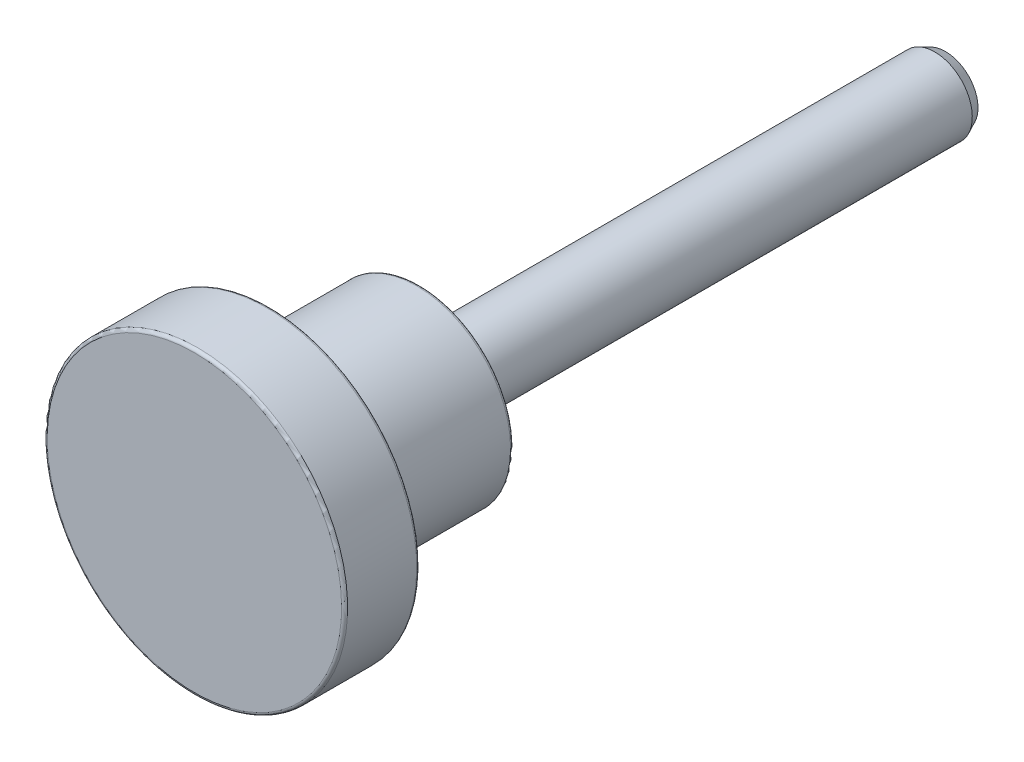
ISO-10303-21;
HEADER;
FILE_DESCRIPTION(('STEP AP214'),'2;1');
FILE_NAME('part.step','',(''),(''),'','','');
FILE_SCHEMA(('AUTOMOTIVE_DESIGN { 1 0 10303 214 1 1 1 1 }'));
ENDSEC;
DATA;
#1=APPLICATION_CONTEXT('core data for automotive mechanical design processes');
#2=APPLICATION_PROTOCOL_DEFINITION('international standard','automotive_design',2000,#1);
#3=PRODUCT_CONTEXT('',#1,'mechanical');
#4=PRODUCT('Part','Part','',(#3));
#5=PRODUCT_RELATED_PRODUCT_CATEGORY('part','',(#4));
#6=PRODUCT_DEFINITION_FORMATION('','',#4);
#7=PRODUCT_DEFINITION_CONTEXT('part definition',#1,'design');
#8=PRODUCT_DEFINITION('design','',#6,#7);
#9=PRODUCT_DEFINITION_SHAPE('','',#8);
#10=(LENGTH_UNIT() NAMED_UNIT(*) SI_UNIT(.MILLI.,.METRE.));
#11=(NAMED_UNIT(*) PLANE_ANGLE_UNIT() SI_UNIT($,.RADIAN.));
#12=(NAMED_UNIT(*) SI_UNIT($,.STERADIAN.) SOLID_ANGLE_UNIT());
#13=UNCERTAINTY_MEASURE_WITH_UNIT(LENGTH_MEASURE(1.E-05),#10,'distance_accuracy_value','');
#14=(GEOMETRIC_REPRESENTATION_CONTEXT(3) GLOBAL_UNCERTAINTY_ASSIGNED_CONTEXT((#13)) GLOBAL_UNIT_ASSIGNED_CONTEXT((#10,
#11,#12)) REPRESENTATION_CONTEXT('',''));
#15=CARTESIAN_POINT('',(0.,0.,0.));
#16=DIRECTION('',(0.,0.,1.));
#17=DIRECTION('',(1.,0.,0.));
#18=AXIS2_PLACEMENT_3D('',#15,#16,#17);
#19=CARTESIAN_POINT('',(0.,0.,8.5598));
#20=DIRECTION('',(0.,0.,-1.));
#21=DIRECTION('',(0.,1.,0.));
#22=AXIS2_PLACEMENT_3D('',#19,#20,#21);
#23=CYLINDRICAL_SURFACE('',#22,3.175);
#24=CARTESIAN_POINT('',(0.,0.,22.225));
#25=DIRECTION('',(0.,0.,1.));
#26=DIRECTION('',(0.,-1.,0.));
#27=AXIS2_PLACEMENT_3D('',#24,#25,#26);
#28=CIRCLE('',#27,3.175);
#29=CARTESIAN_POINT('',(0.,-3.175,22.225));
#30=VERTEX_POINT('',#29);
#31=EDGE_CURVE('E58',#30,#30,#28,.F.);
#32=ORIENTED_EDGE('',*,*,#31,.T.);
#33=EDGE_LOOP('',(#32));
#34=FACE_BOUND('',#33,.T.);
#35=CARTESIAN_POINT('',(0.,0.,-21.3178571428572));
#36=DIRECTION('',(0.,0.,1.));
#37=DIRECTION('',(0.,-1.,0.));
#38=AXIS2_PLACEMENT_3D('',#35,#36,#37);
#39=CIRCLE('',#38,3.175);
#40=CARTESIAN_POINT('',(0.,-3.17500000000001,-21.3178571428572));
#41=VERTEX_POINT('',#40);
#42=EDGE_CURVE('E67',#41,#41,#39,.T.);
#43=ORIENTED_EDGE('',*,*,#42,.T.);
#44=EDGE_LOOP('',(#43));
#45=FACE_BOUND('',#44,.T.);
#46=ADVANCED_FACE('F32',(#34,#45),#23,.T.);
#47=CARTESIAN_POINT('',(0.,7.9375,22.225));
#48=DIRECTION('',(0.,0.,1.));
#49=DIRECTION('',(0.,-1.,0.));
#50=AXIS2_PLACEMENT_3D('',#47,#48,#49);
#51=PLANE('',#50);
#52=CARTESIAN_POINT('',(0.,0.,22.225));
#53=DIRECTION('',(0.,0.,1.));
#54=DIRECTION('',(0.,-1.,0.));
#55=AXIS2_PLACEMENT_3D('',#52,#53,#54);
#56=CIRCLE('',#55,7.6835);
#57=CARTESIAN_POINT('',(0.,-7.6835,22.225));
#58=VERTEX_POINT('',#57);
#59=EDGE_CURVE('E52',#58,#58,#56,.F.);
#60=ORIENTED_EDGE('',*,*,#59,.T.);
#61=EDGE_LOOP('',(#60));
#62=FACE_BOUND('',#61,.T.);
#63=ORIENTED_EDGE('',*,*,#31,.F.);
#64=EDGE_LOOP('',(#63));
#65=FACE_BOUND('',#64,.T.);
#66=ADVANCED_FACE('F88',(#62,#65),#51,.F.);
#67=CARTESIAN_POINT('',(0.,0.,22.225));
#68=DIRECTION('',(0.,0.,1.));
#69=DIRECTION('',(0.,-1.,0.));
#70=AXIS2_PLACEMENT_3D('',#67,#68,#69);
#71=CYLINDRICAL_SURFACE('',#70,7.9375);
#72=CARTESIAN_POINT('',(0.,0.,22.479));
#73=DIRECTION('',(0.,0.,1.));
#74=DIRECTION('',(0.,-1.,0.));
#75=AXIS2_PLACEMENT_3D('',#72,#73,#74);
#76=CIRCLE('',#75,7.9375);
#77=CARTESIAN_POINT('',(0.,-7.9375,22.479));
#78=VERTEX_POINT('',#77);
#79=EDGE_CURVE('E55',#78,#78,#76,.T.);
#80=ORIENTED_EDGE('',*,*,#79,.T.);
#81=EDGE_LOOP('',(#80));
#82=FACE_BOUND('',#81,.T.);
#83=CARTESIAN_POINT('',(0.,0.,34.925));
#84=DIRECTION('',(0.,0.,1.));
#85=DIRECTION('',(0.,-1.,0.));
#86=AXIS2_PLACEMENT_3D('',#83,#84,#85);
#87=CIRCLE('',#86,7.9375);
#88=CARTESIAN_POINT('',(0.,-7.9375,34.925));
#89=VERTEX_POINT('',#88);
#90=EDGE_CURVE('E61',#89,#89,#87,.T.);
#91=ORIENTED_EDGE('',*,*,#90,.F.);
#92=EDGE_LOOP('',(#91));
#93=FACE_BOUND('',#92,.T.);
#94=ADVANCED_FACE('F94',(#82,#93),#71,.T.);
#95=CARTESIAN_POINT('',(0.,7.9375,34.925));
#96=DIRECTION('',(0.,0.,1.));
#97=DIRECTION('',(0.,-1.,0.));
#98=AXIS2_PLACEMENT_3D('',#95,#96,#97);
#99=PLANE('',#98);
#100=CARTESIAN_POINT('',(0.,0.,34.925));
#101=DIRECTION('',(0.,0.,1.));
#102=DIRECTION('',(0.,-1.,0.));
#103=AXIS2_PLACEMENT_3D('',#100,#101,#102);
#104=CIRCLE('',#103,12.446);
#105=CARTESIAN_POINT('',(0.,-12.446,34.925));
#106=VERTEX_POINT('',#105);
#107=EDGE_CURVE('E39',#106,#106,#104,.F.);
#108=ORIENTED_EDGE('',*,*,#107,.T.);
#109=EDGE_LOOP('',(#108));
#110=FACE_BOUND('',#109,.T.);
#111=ORIENTED_EDGE('',*,*,#90,.T.);
#112=EDGE_LOOP('',(#111));
#113=FACE_BOUND('',#112,.T.);
#114=ADVANCED_FACE('F113',(#110,#113),#99,.F.);
#115=CARTESIAN_POINT('',(0.,0.,22.225));
#116=DIRECTION('',(0.,0.,1.));
#117=DIRECTION('',(0.,-1.,0.));
#118=AXIS2_PLACEMENT_3D('',#115,#116,#117);
#119=CYLINDRICAL_SURFACE('',#118,12.7);
#120=CARTESIAN_POINT('',(0.,0.,35.179));
#121=DIRECTION('',(0.,0.,1.));
#122=DIRECTION('',(0.,-1.,0.));
#123=AXIS2_PLACEMENT_3D('',#120,#121,#122);
#124=CIRCLE('',#123,12.7);
#125=CARTESIAN_POINT('',(0.,-12.7,35.179));
#126=VERTEX_POINT('',#125);
#127=EDGE_CURVE('E43',#126,#126,#124,.T.);
#128=ORIENTED_EDGE('',*,*,#127,.T.);
#129=EDGE_LOOP('',(#128));
#130=FACE_BOUND('',#129,.T.);
#131=CARTESIAN_POINT('',(0.,0.,41.021));
#132=DIRECTION('',(0.,0.,-1.));
#133=DIRECTION('',(0.,1.,0.));
#134=AXIS2_PLACEMENT_3D('',#131,#132,#133);
#135=CIRCLE('',#134,12.7);
#136=CARTESIAN_POINT('',(0.,12.7,41.021));
#137=VERTEX_POINT('',#136);
#138=EDGE_CURVE('E47',#137,#137,#135,.T.);
#139=ORIENTED_EDGE('',*,*,#138,.T.);
#140=EDGE_LOOP('',(#139));
#141=FACE_BOUND('',#140,.T.);
#142=ADVANCED_FACE('F85',(#130,#141),#119,.T.);
#143=CARTESIAN_POINT('',(0.,12.7,41.275));
#144=DIRECTION('',(0.,0.,-1.));
#145=DIRECTION('',(0.,1.,0.));
#146=AXIS2_PLACEMENT_3D('',#143,#144,#145);
#147=PLANE('',#146);
#148=CARTESIAN_POINT('',(0.,0.,41.275));
#149=DIRECTION('',(0.,0.,-1.));
#150=DIRECTION('',(0.,1.,0.));
#151=AXIS2_PLACEMENT_3D('',#148,#149,#150);
#152=CIRCLE('',#151,12.446);
#153=CARTESIAN_POINT('',(0.,12.446,41.275));
#154=VERTEX_POINT('',#153);
#155=EDGE_CURVE('E11',#154,#154,#152,.F.);
#156=ORIENTED_EDGE('',*,*,#155,.T.);
#157=EDGE_LOOP('',(#156));
#158=FACE_BOUND('',#157,.T.);
#159=ADVANCED_FACE('F75',(#158),#147,.F.);
#160=CARTESIAN_POINT('',(0.,0.,-21.3178571428572));
#161=DIRECTION('',(0.,0.,1.));
#162=DIRECTION('',(0.,-1.,0.));
#163=AXIS2_PLACEMENT_3D('',#160,#161,#162);
#164=CONICAL_SURFACE('',#163,3.175,0.436332312998576);
#165=CARTESIAN_POINT('',(0.,0.,-22.225));
#166=DIRECTION('',(0.,0.,1.));
#167=DIRECTION('',(0.,-1.,0.));
#168=AXIS2_PLACEMENT_3D('',#165,#166,#167);
#169=CIRCLE('',#168,2.75199233867369);
#170=CARTESIAN_POINT('',(0.,-2.75199233867369,-22.225));
#171=VERTEX_POINT('',#170);
#172=EDGE_CURVE('E64',#171,#171,#169,.T.);
#173=ORIENTED_EDGE('',*,*,#172,.T.);
#174=EDGE_LOOP('',(#173));
#175=FACE_BOUND('',#174,.T.);
#176=ORIENTED_EDGE('',*,*,#42,.F.);
#177=EDGE_LOOP('',(#176));
#178=FACE_BOUND('',#177,.T.);
#179=ADVANCED_FACE('F72',(#175,#178),#164,.T.);
#180=CARTESIAN_POINT('',(0.,3.175,-22.225));
#181=DIRECTION('',(0.,0.,-1.));
#182=DIRECTION('',(0.,1.,0.));
#183=AXIS2_PLACEMENT_3D('',#180,#181,#182);
#184=PLANE('',#183);
#185=ORIENTED_EDGE('',*,*,#172,.F.);
#186=EDGE_LOOP('',(#185));
#187=FACE_BOUND('',#186,.T.);
#188=ADVANCED_FACE('F74',(#187),#184,.T.);
#189=CARTESIAN_POINT('',(0.,0.,22.479));
#190=DIRECTION('',(0.,0.,1.));
#191=DIRECTION('',(0.,-1.,0.));
#192=AXIS2_PLACEMENT_3D('',#189,#190,#191);
#193=TOROIDAL_SURFACE('',#192,7.6835,0.254);
#194=ORIENTED_EDGE('',*,*,#59,.F.);
#195=EDGE_LOOP('',(#194));
#196=FACE_BOUND('',#195,.T.);
#197=ORIENTED_EDGE('',*,*,#79,.F.);
#198=EDGE_LOOP('',(#197));
#199=FACE_BOUND('',#198,.T.);
#200=ADVANCED_FACE('F82',(#196,#199),#193,.T.);
#201=CARTESIAN_POINT('',(0.,0.,35.179));
#202=DIRECTION('',(0.,0.,1.));
#203=DIRECTION('',(0.,-1.,0.));
#204=AXIS2_PLACEMENT_3D('',#201,#202,#203);
#205=TOROIDAL_SURFACE('',#204,12.446,0.254);
#206=ORIENTED_EDGE('',*,*,#107,.F.);
#207=EDGE_LOOP('',(#206));
#208=FACE_BOUND('',#207,.T.);
#209=ORIENTED_EDGE('',*,*,#127,.F.);
#210=EDGE_LOOP('',(#209));
#211=FACE_BOUND('',#210,.T.);
#212=ADVANCED_FACE('F100',(#208,#211),#205,.T.);
#213=CARTESIAN_POINT('',(0.,0.,41.021));
#214=DIRECTION('',(0.,0.,-1.));
#215=DIRECTION('',(0.,1.,0.));
#216=AXIS2_PLACEMENT_3D('',#213,#214,#215);
#217=TOROIDAL_SURFACE('',#216,12.446,0.254);
#218=ORIENTED_EDGE('',*,*,#138,.F.);
#219=EDGE_LOOP('',(#218));
#220=FACE_BOUND('',#219,.T.);
#221=ORIENTED_EDGE('',*,*,#155,.F.);
#222=EDGE_LOOP('',(#221));
#223=FACE_BOUND('',#222,.T.);
#224=ADVANCED_FACE('F34',(#220,#223),#217,.T.);
#225=CLOSED_SHELL('',(#46,#66,#94,#114,#142,#159,#179,#188,#200,#212,#224));
#226=MANIFOLD_SOLID_BREP('B2',#225);
#227=ADVANCED_BREP_SHAPE_REPRESENTATION('',(#18,#226),#14);
#228=SHAPE_DEFINITION_REPRESENTATION(#9,#227);
ENDSEC;
END-ISO-10303-21;
